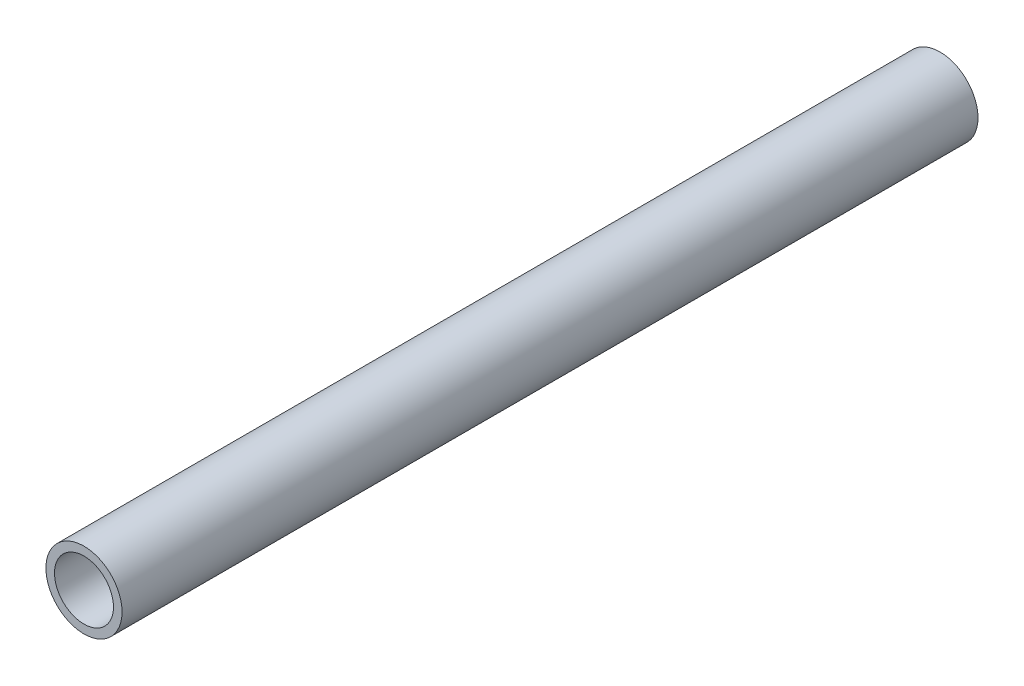
ISO-10303-21;
HEADER;
FILE_DESCRIPTION(('STEP AP214'),'2;1');
FILE_NAME('part.step','',(''),(''),'','','');
FILE_SCHEMA(('AUTOMOTIVE_DESIGN { 1 0 10303 214 1 1 1 1 }'));
ENDSEC;
DATA;
#1=APPLICATION_CONTEXT('core data for automotive mechanical design processes');
#2=APPLICATION_PROTOCOL_DEFINITION('international standard','automotive_design',2000,#1);
#3=PRODUCT_CONTEXT('',#1,'mechanical');
#4=PRODUCT('Part','Part','',(#3));
#5=PRODUCT_RELATED_PRODUCT_CATEGORY('part','',(#4));
#6=PRODUCT_DEFINITION_FORMATION('','',#4);
#7=PRODUCT_DEFINITION_CONTEXT('part definition',#1,'design');
#8=PRODUCT_DEFINITION('design','',#6,#7);
#9=PRODUCT_DEFINITION_SHAPE('','',#8);
#10=(LENGTH_UNIT() NAMED_UNIT(*) SI_UNIT(.MILLI.,.METRE.));
#11=(NAMED_UNIT(*) PLANE_ANGLE_UNIT() SI_UNIT($,.RADIAN.));
#12=(NAMED_UNIT(*) SI_UNIT($,.STERADIAN.) SOLID_ANGLE_UNIT());
#13=UNCERTAINTY_MEASURE_WITH_UNIT(LENGTH_MEASURE(1.E-05),#10,'distance_accuracy_value','');
#14=(GEOMETRIC_REPRESENTATION_CONTEXT(3) GLOBAL_UNCERTAINTY_ASSIGNED_CONTEXT((#13)) GLOBAL_UNIT_ASSIGNED_CONTEXT((#10,
#11,#12)) REPRESENTATION_CONTEXT('',''));
#15=CARTESIAN_POINT('',(0.,0.,0.));
#16=DIRECTION('',(0.,0.,1.));
#17=DIRECTION('',(1.,0.,0.));
#18=AXIS2_PLACEMENT_3D('',#15,#16,#17);
#19=CARTESIAN_POINT('',(0.,0.,150.));
#20=DIRECTION('',(0.,0.,1.));
#21=DIRECTION('',(1.,0.,0.));
#22=AXIS2_PLACEMENT_3D('',#19,#20,#21);
#23=PLANE('',#22);
#24=CARTESIAN_POINT('',(0.,0.,150.));
#25=DIRECTION('',(0.,0.,1.));
#26=DIRECTION('',(1.,0.,0.));
#27=AXIS2_PLACEMENT_3D('',#24,#25,#26);
#28=CIRCLE('',#27,13.335);
#29=CARTESIAN_POINT('',(13.335,0.,150.));
#30=VERTEX_POINT('',#29);
#31=EDGE_CURVE('E10',#30,#30,#28,.T.);
#32=ORIENTED_EDGE('',*,*,#31,.T.);
#33=EDGE_LOOP('',(#32));
#34=FACE_BOUND('',#33,.T.);
#35=CARTESIAN_POINT('',(0.,0.,150.));
#36=DIRECTION('',(0.,0.,1.));
#37=DIRECTION('',(1.,0.,0.));
#38=AXIS2_PLACEMENT_3D('',#35,#36,#37);
#39=CIRCLE('',#38,10.335);
#40=CARTESIAN_POINT('',(10.335,0.,150.));
#41=VERTEX_POINT('',#40);
#42=EDGE_CURVE('E52',#41,#41,#39,.T.);
#43=ORIENTED_EDGE('',*,*,#42,.F.);
#44=EDGE_LOOP('',(#43));
#45=FACE_BOUND('',#44,.T.);
#46=ADVANCED_FACE('F41',(#34,#45),#23,.T.);
#47=CARTESIAN_POINT('',(0.,0.,-150.));
#48=DIRECTION('',(0.,0.,1.));
#49=DIRECTION('',(1.,0.,0.));
#50=AXIS2_PLACEMENT_3D('',#47,#48,#49);
#51=PLANE('',#50);
#52=CARTESIAN_POINT('',(0.,0.,-150.));
#53=DIRECTION('',(0.,0.,1.));
#54=DIRECTION('',(1.,0.,0.));
#55=AXIS2_PLACEMENT_3D('',#52,#53,#54);
#56=CIRCLE('',#55,13.335);
#57=CARTESIAN_POINT('',(13.335,0.,-150.));
#58=VERTEX_POINT('',#57);
#59=EDGE_CURVE('E45',#58,#58,#56,.T.);
#60=ORIENTED_EDGE('',*,*,#59,.F.);
#61=EDGE_LOOP('',(#60));
#62=FACE_BOUND('',#61,.T.);
#63=CARTESIAN_POINT('',(0.,0.,-150.));
#64=DIRECTION('',(0.,0.,1.));
#65=DIRECTION('',(1.,0.,0.));
#66=AXIS2_PLACEMENT_3D('',#63,#64,#65);
#67=CIRCLE('',#66,10.335);
#68=CARTESIAN_POINT('',(10.335,0.,-150.));
#69=VERTEX_POINT('',#68);
#70=EDGE_CURVE('E54',#69,#69,#67,.T.);
#71=ORIENTED_EDGE('',*,*,#70,.T.);
#72=EDGE_LOOP('',(#71));
#73=FACE_BOUND('',#72,.T.);
#74=ADVANCED_FACE('F64',(#62,#73),#51,.F.);
#75=CARTESIAN_POINT('',(0.,0.,150.));
#76=DIRECTION('',(0.,0.,-1.));
#77=DIRECTION('',(-1.,0.,0.));
#78=AXIS2_PLACEMENT_3D('',#75,#76,#77);
#79=CYLINDRICAL_SURFACE('',#78,13.335);
#80=ORIENTED_EDGE('',*,*,#31,.F.);
#81=EDGE_LOOP('',(#80));
#82=FACE_BOUND('',#81,.T.);
#83=ORIENTED_EDGE('',*,*,#59,.T.);
#84=EDGE_LOOP('',(#83));
#85=FACE_BOUND('',#84,.T.);
#86=ADVANCED_FACE('F43',(#82,#85),#79,.T.);
#87=CARTESIAN_POINT('',(0.,0.,150.));
#88=DIRECTION('',(0.,0.,-1.));
#89=DIRECTION('',(-1.,0.,0.));
#90=AXIS2_PLACEMENT_3D('',#87,#88,#89);
#91=CYLINDRICAL_SURFACE('',#90,10.335);
#92=ORIENTED_EDGE('',*,*,#42,.T.);
#93=EDGE_LOOP('',(#92));
#94=FACE_BOUND('',#93,.T.);
#95=ORIENTED_EDGE('',*,*,#70,.F.);
#96=EDGE_LOOP('',(#95));
#97=FACE_BOUND('',#96,.T.);
#98=ADVANCED_FACE('F60',(#94,#97),#91,.F.);
#99=CLOSED_SHELL('',(#46,#74,#86,#98));
#100=MANIFOLD_SOLID_BREP('B2',#99);
#101=ADVANCED_BREP_SHAPE_REPRESENTATION('',(#18,#100),#14);
#102=SHAPE_DEFINITION_REPRESENTATION(#9,#101);
ENDSEC;
END-ISO-10303-21;
